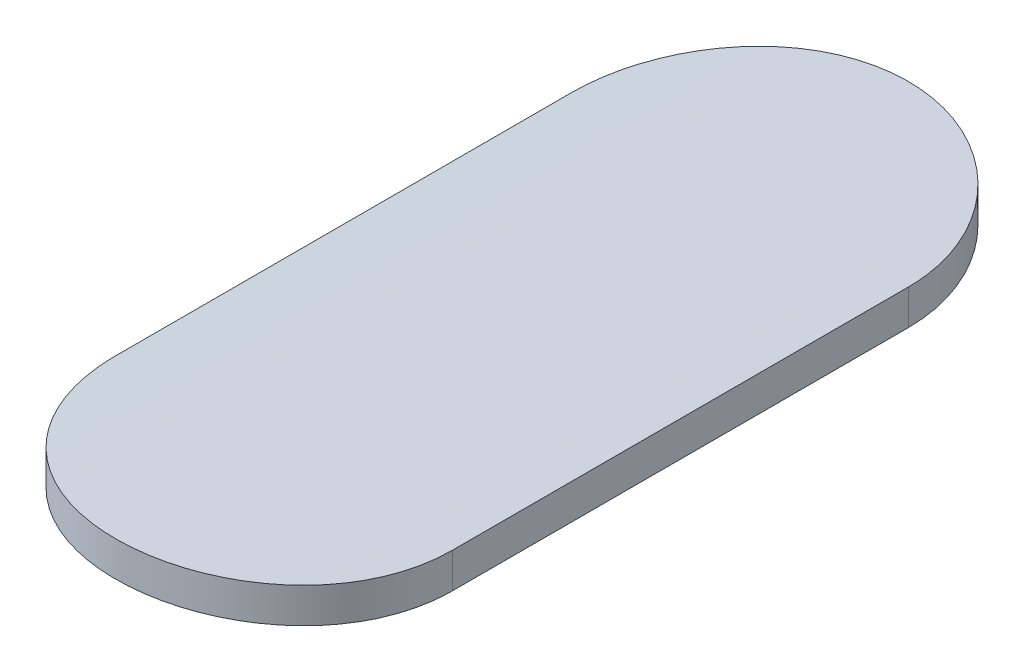
ISO-10303-21;
HEADER;
FILE_DESCRIPTION(('STEP AP214'),'2;1');
FILE_NAME('part.step','',(''),(''),'','','');
FILE_SCHEMA(('AUTOMOTIVE_DESIGN { 1 0 10303 214 1 1 1 1 }'));
ENDSEC;
DATA;
#1=APPLICATION_CONTEXT('core data for automotive mechanical design processes');
#2=APPLICATION_PROTOCOL_DEFINITION('international standard','automotive_design',2000,#1);
#3=PRODUCT_CONTEXT('',#1,'mechanical');
#4=PRODUCT('Part','Part','',(#3));
#5=PRODUCT_RELATED_PRODUCT_CATEGORY('part','',(#4));
#6=PRODUCT_DEFINITION_FORMATION('','',#4);
#7=PRODUCT_DEFINITION_CONTEXT('part definition',#1,'design');
#8=PRODUCT_DEFINITION('design','',#6,#7);
#9=PRODUCT_DEFINITION_SHAPE('','',#8);
#10=(LENGTH_UNIT() NAMED_UNIT(*) SI_UNIT(.MILLI.,.METRE.));
#11=(NAMED_UNIT(*) PLANE_ANGLE_UNIT() SI_UNIT($,.RADIAN.));
#12=(NAMED_UNIT(*) SI_UNIT($,.STERADIAN.) SOLID_ANGLE_UNIT());
#13=UNCERTAINTY_MEASURE_WITH_UNIT(LENGTH_MEASURE(1.E-05),#10,'distance_accuracy_value','');
#14=(GEOMETRIC_REPRESENTATION_CONTEXT(3) GLOBAL_UNCERTAINTY_ASSIGNED_CONTEXT((#13)) GLOBAL_UNIT_ASSIGNED_CONTEXT((#10,
#11,#12)) REPRESENTATION_CONTEXT('',''));
#15=CARTESIAN_POINT('',(0.,0.,0.));
#16=DIRECTION('',(0.,0.,1.));
#17=DIRECTION('',(1.,0.,0.));
#18=AXIS2_PLACEMENT_3D('',#15,#16,#17);
#19=CARTESIAN_POINT('',(-205.237767720161,-97.4477839792411,1.93657000024666));
#20=DIRECTION('',(0.,0.,1.));
#21=DIRECTION('',(1.,0.,0.));
#22=AXIS2_PLACEMENT_3D('',#19,#20,#21);
#23=CYLINDRICAL_SURFACE('',#22,5.00000000000003);
#24=DIRECTION('',(0.,0.,1.));
#25=VECTOR('',#24,1.);
#26=CARTESIAN_POINT('',(-205.816025312001,-92.4813347287725,2.83206474743267));
#27=LINE('',#26,#25);
#28=CARTESIAN_POINT('',(-205.816025312001,-92.4813347287725,1.26705566906287));
#29=VERTEX_POINT('',#28);
#30=CARTESIAN_POINT('',(-205.816025312001,-92.4813347287725,2.83206474743267));
#31=VERTEX_POINT('',#30);
#32=EDGE_CURVE('E72',#29,#31,#27,.T.);
#33=ORIENTED_EDGE('',*,*,#32,.T.);
#34=CARTESIAN_POINT('',(-204.659510128705,-92.4813347287279,2.83206474743267));
#35=CARTESIAN_POINT('',(-204.65948198318,-92.4813470453749,2.86448083062688));
#36=CARTESIAN_POINT('',(-204.66223416535,-92.4810176971892,2.89688619887213));
#37=CARTESIAN_POINT('',(-204.673088717127,-92.4797671597198,2.96074448500112));
#38=CARTESIAN_POINT('',(-204.681185705116,-92.4788465657793,2.99219832768205));
#39=CARTESIAN_POINT('',(-204.702524070631,-92.4765042566045,3.0533024933699));
#40=CARTESIAN_POINT('',(-204.715767326654,-92.4750823584012,3.08295215323607));
#41=CARTESIAN_POINT('',(-204.747006549714,-92.4719020810574,3.1396049404931));
#42=CARTESIAN_POINT('',(-204.765001863621,-92.4701437481661,3.16660843087947));
#43=CARTESIAN_POINT('',(-204.805325364428,-92.4664785790867,3.21733039993261));
#44=CARTESIAN_POINT('',(-204.827671036202,-92.4645711628689,3.24103493719126));
#45=CARTESIAN_POINT('',(-204.876032349208,-92.4608275253215,3.28437421471046));
#46=CARTESIAN_POINT('',(-204.902049364491,-92.4589913309773,3.30400742439501));
#47=CARTESIAN_POINT('',(-204.957107529511,-92.4555908299197,3.33869494452619));
#48=CARTESIAN_POINT('',(-204.986158174165,-92.4540274204009,3.35373426293955));
#49=CARTESIAN_POINT('',(-205.046371666948,-92.4513580548523,3.37869922051583));
#50=CARTESIAN_POINT('',(-205.077531998354,-92.4502515645608,3.3886308353169));
#51=CARTESIAN_POINT('',(-205.13034615267,-92.4488934431359,3.40066816087081));
#52=CARTESIAN_POINT('',(-205.151664012772,-92.4484793797971,3.40428335727667));
#53=CARTESIAN_POINT('',(-205.194574057236,-92.4479245041211,3.40911092828111));
#54=CARTESIAN_POINT('',(-205.216166245618,-92.4477836957932,3.41032326762364));
#55=CARTESIAN_POINT('',(-205.270132833281,-92.4477844039261,3.41032094786131));
#56=CARTESIAN_POINT('',(-205.302518792684,-92.448101558574,3.40759595145511));
#57=CARTESIAN_POINT('',(-205.36639046982,-92.449336246177,3.39676770255847));
#58=CARTESIAN_POINT('',(-205.397875198236,-92.4502544143552,3.38865875953881));
#59=CARTESIAN_POINT('',(-205.459010687186,-92.4525875978119,3.36730369344967));
#60=CARTESIAN_POINT('',(-205.488662624789,-92.4540022902267,3.35406090806612));
#61=CARTESIAN_POINT('',(-205.545317635545,-92.4571708752444,3.32282065546445));
#62=CARTESIAN_POINT('',(-205.572321144898,-92.4589247118479,3.30482397303095));
#63=CARTESIAN_POINT('',(-205.623045523049,-92.4625847434808,3.26449632593292));
#64=CARTESIAN_POINT('',(-205.646752120136,-92.4644915478026,3.24214746487877));
#65=CARTESIAN_POINT('',(-205.690087991771,-92.4682377457699,3.19378617130073));
#66=CARTESIAN_POINT('',(-205.709716908808,-92.4700771334931,3.16777341788066));
#67=CARTESIAN_POINT('',(-205.744395340358,-92.4734866329095,3.11272837641825));
#68=CARTESIAN_POINT('',(-205.759430426865,-92.4750558895899,3.083686951524));
#69=CARTESIAN_POINT('',(-205.784398136002,-92.4777383200303,3.02347434336881));
#70=CARTESIAN_POINT('',(-205.794333600315,-92.4788517477236,2.99230435721046));
#71=CARTESIAN_POINT('',(-205.806375173798,-92.4802182866102,2.93946661392135));
#72=CARTESIAN_POINT('',(-205.809991257807,-92.4806348583557,2.91813495665772));
#73=CARTESIAN_POINT('',(-205.81481628588,-92.4811939415349,2.87522689266801));
#74=CARTESIAN_POINT('',(-205.816028473882,-92.4813368222921,2.85365085534277));
#75=CARTESIAN_POINT('',(-205.816025312001,-92.4813347287726,2.83206474743267));
#76=B_SPLINE_CURVE_WITH_KNOTS('',3,(#34,#35,#36,#37,#38,#39,#40,#41,#42,#43,#44,#45,#46,#47,#48,
#49,#50,#51,#52,#53,#54,#55,#56,#57,#58,#59,#60,#61,#62,#63,#64,#65,#66,#67,#68,#69,#70,#71,#72,
#73,#74,#75),.UNSPECIFIED.,.F.,.F.,(4,2,2,2,2,2,2,2,2,2,2,2,2,2,2,2,2,2,2,2,4),(0.,
0.0971141698560029,0.194130705514869,0.291182687565263,0.388221337553571,0.485658369900075,
0.583131966607678,0.680920348294449,0.778594063001622,0.843344867671607,0.908096622394174,
1.00511304740935,1.10223217692016,1.19928827157682,1.29632835398478,1.3937762336066,
1.49123265335908,1.58899208404563,1.68669698057033,1.75148885975865,1.81619324588167),.UNSPECIFIED.);
#77=CARTESIAN_POINT('',(-204.659510128705,-92.4813347287279,2.83206474743267));
#78=VERTEX_POINT('',#77);
#79=EDGE_CURVE('E21',#78,#31,#76,.T.);
#80=ORIENTED_EDGE('',*,*,#79,.F.);
#81=DIRECTION('',(0.,0.,1.));
#82=VECTOR('',#81,1.);
#83=CARTESIAN_POINT('',(-204.659510128705,-92.4813347287279,1.26705566906287));
#84=LINE('',#83,#82);
#85=CARTESIAN_POINT('',(-204.659510128705,-92.4813347287279,1.26705566906287));
#86=VERTEX_POINT('',#85);
#87=EDGE_CURVE('E59',#78,#86,#84,.F.);
#88=ORIENTED_EDGE('',*,*,#87,.T.);
#89=CARTESIAN_POINT('',(-205.816025312001,-92.4813347287726,1.26705566906287));
#90=CARTESIAN_POINT('',(-205.81605345322,-92.4813470455981,1.23463948872486));
#91=CARTESIAN_POINT('',(-205.813301256707,-92.4810176953498,1.2022340235754));
#92=CARTESIAN_POINT('',(-205.802446677341,-92.4797671542148,1.13837574289801));
#93=CARTESIAN_POINT('',(-205.794349708049,-92.4788465622047,1.10692199708066));
#94=CARTESIAN_POINT('',(-205.773011592033,-92.4765042816047,1.04581857159091));
#95=CARTESIAN_POINT('',(-205.759768660538,-92.4750824191753,1.01616952197206));
#96=CARTESIAN_POINT('',(-205.728529674045,-92.4719021558279,0.959516628595242));
#97=CARTESIAN_POINT('',(-205.710534070537,-92.4701437868815,0.932512533908073));
#98=CARTESIAN_POINT('',(-205.670207756246,-92.4664783744416,0.881787170962223));
#99=CARTESIAN_POINT('',(-205.647859171863,-92.4645707380577,0.858080153163636));
#100=CARTESIAN_POINT('',(-205.599497501548,-92.460827112354,0.814741829426293));
#101=CARTESIAN_POINT('',(-205.573483858366,-92.4589911339836,0.79511114439307));
#102=CARTESIAN_POINT('',(-205.518441967116,-92.4555917582716,0.760434779110686));
#103=CARTESIAN_POINT('',(-205.489405485113,-92.4540291382538,0.745402085847937));
#104=CARTESIAN_POINT('',(-205.429200909222,-92.4513592357457,0.720432369036938));
#105=CARTESIAN_POINT('',(-205.398033010825,-92.4502519115612,0.710494878870013));
#106=CARTESIAN_POINT('',(-205.334596648131,-92.4486214638352,0.696039431545376));
#107=CARTESIAN_POINT('',(-205.302333729771,-92.4480957495245,0.691497433550006));
#108=CARTESIAN_POINT('',(-205.237498790808,-92.4476789168199,0.68788741976827));
#109=CARTESIAN_POINT('',(-205.204926773204,-92.4477877922755,0.688819350928851));
#110=CARTESIAN_POINT('',(-205.140563410856,-92.4486257894006,0.696111573201619));
#111=CARTESIAN_POINT('',(-205.108769075323,-92.4493519393145,0.702445856156913));
#112=CARTESIAN_POINT('',(-205.046697948224,-92.4513395212461,0.720322340750312));
#113=CARTESIAN_POINT('',(-205.016421173954,-92.4526009593627,0.731864601727551));
#114=CARTESIAN_POINT('',(-204.958162773233,-92.4555225006161,0.759857664963218));
#115=CARTESIAN_POINT('',(-204.930186698027,-92.4571835321094,0.776319919517476));
#116=CARTESIAN_POINT('',(-204.87738579882,-92.4607180906581,0.81367655545564));
#117=CARTESIAN_POINT('',(-204.852560962508,-92.4625916168832,0.834570919522292));
#118=CARTESIAN_POINT('',(-204.806616299284,-92.4663540775476,0.880341586026436));
#119=CARTESIAN_POINT('',(-204.785518493568,-92.4682430387985,0.905239996827502));
#120=CARTESIAN_POINT('',(-204.747792196947,-92.4718132541877,0.958244851151834));
#121=CARTESIAN_POINT('',(-204.731165046413,-92.473494445952,0.986352253189699));
#122=CARTESIAN_POINT('',(-204.702849827051,-92.4764596597479,1.04500439396426));
#123=CARTESIAN_POINT('',(-204.691166312109,-92.4777433152941,1.07555134927182));
#124=CARTESIAN_POINT('',(-204.67312304922,-92.479759834021,1.13815473004955));
#125=CARTESIAN_POINT('',(-204.666755270332,-92.4804935279044,1.17020880090798));
#126=CARTESIAN_POINT('',(-204.660710580302,-92.4811955947182,1.22397438759134));
#127=CARTESIAN_POINT('',(-204.659499727931,-92.4813388156744,1.2455201361297));
#128=CARTESIAN_POINT('',(-204.659510128705,-92.4813347287279,1.26705566906287));
#129=B_SPLINE_CURVE_WITH_KNOTS('',3,(#89,#90,#91,#92,#93,#94,#95,#96,#97,#98,#99,#100,#101,#102,
#103,#104,#105,#106,#107,#108,#109,#110,#111,#112,#113,#114,#115,#116,#117,#118,#119,#120,#121,
#122,#123,#124,#125,#126,#127,#128),.UNSPECIFIED.,.F.,.F.,(4,2,2,2,2,2,2,2,2,2,2,2,2,2,2,2,2,2,
2,4),(0.,0.0971144596016325,0.194130705508774,0.291180629617421,0.3882213375778,
0.485669235954979,0.583131966690334,0.680867490696589,0.778594062484608,0.875883538275934,
0.973172071143985,1.06999486157763,1.16681875522746,1.2638698053772,1.36092047633353,
1.4585266740161,1.55616210298787,1.65388727516014,1.75146453691094,1.81606442695371),.UNSPECIFIED.);
#130=EDGE_CURVE('E73',#29,#86,#129,.T.);
#131=ORIENTED_EDGE('',*,*,#130,.F.);
#132=EDGE_LOOP('',(#33,#80,#88,#131));
#133=FACE_BOUND('',#132,.T.);
#134=ADVANCED_FACE('F17',(#133),#23,.T.);
#135=CARTESIAN_POINT('',(-205.816025312001,-90.5682667595488,2.83206474743267));
#136=DIRECTION('',(1.,0.,0.));
#137=DIRECTION('',(0.,1.,0.));
#138=AXIS2_PLACEMENT_3D('',#135,#136,#137);
#139=PLANE('',#138);
#140=DIRECTION('',(0.,0.,1.));
#141=VECTOR('',#140,1.);
#142=CARTESIAN_POINT('',(-205.816025312001,-92.6021655298087,1.93657000024666));
#143=LINE('',#142,#141);
#144=CARTESIAN_POINT('',(-205.816025312001,-92.6021655298087,1.26705566906287));
#145=VERTEX_POINT('',#144);
#146=CARTESIAN_POINT('',(-205.816025312001,-92.6021655298087,2.83206474743267));
#147=VERTEX_POINT('',#146);
#148=EDGE_CURVE('E80',#145,#147,#143,.T.);
#149=ORIENTED_EDGE('',*,*,#148,.T.);
#150=DIRECTION('',(0.,1.,0.));
#151=VECTOR('',#150,1.);
#152=CARTESIAN_POINT('',(-205.816025312001,-90.5682667595488,2.83206474743267));
#153=LINE('',#152,#151);
#154=EDGE_CURVE('E67',#31,#147,#153,.F.);
#155=ORIENTED_EDGE('',*,*,#154,.F.);
#156=ORIENTED_EDGE('',*,*,#32,.F.);
#157=DIRECTION('',(0.,1.,0.));
#158=VECTOR('',#157,1.);
#159=CARTESIAN_POINT('',(-205.816025312001,-90.5682667595488,1.26705566906287));
#160=LINE('',#159,#158);
#161=EDGE_CURVE('E106',#145,#29,#160,.T.);
#162=ORIENTED_EDGE('',*,*,#161,.F.);
#163=EDGE_LOOP('',(#149,#155,#156,#162));
#164=FACE_BOUND('',#163,.T.);
#165=ADVANCED_FACE('F79',(#164),#139,.F.);
#166=CARTESIAN_POINT('',(-205.237767720353,-90.5682667595488,2.83206474743267));
#167=DIRECTION('',(0.,1.,0.));
#168=DIRECTION('',(0.,0.,1.));
#169=AXIS2_PLACEMENT_3D('',#166,#167,#168);
#170=CYLINDRICAL_SURFACE('',#169,0.578257591648153);
#171=DIRECTION('',(0.,1.,0.));
#172=VECTOR('',#171,1.);
#173=CARTESIAN_POINT('',(-204.659510128705,-90.5682667595488,2.83206474743267));
#174=LINE('',#173,#172);
#175=CARTESIAN_POINT('',(-204.659510128705,-92.6021655297629,2.83206474743267));
#176=VERTEX_POINT('',#175);
#177=EDGE_CURVE('E69',#176,#78,#174,.T.);
#178=ORIENTED_EDGE('',*,*,#177,.T.);
#179=ORIENTED_EDGE('',*,*,#79,.T.);
#180=ORIENTED_EDGE('',*,*,#154,.T.);
#181=CARTESIAN_POINT('',(-205.816025312001,-92.6021655298087,2.83206474743267));
#182=CARTESIAN_POINT('',(-205.816053483011,-92.6021781533448,2.86447510734879));
#183=CARTESIAN_POINT('',(-205.813302242279,-92.6018407072796,2.89687462882628));
#184=CARTESIAN_POINT('',(-205.802451748411,-92.6005594713111,2.96072074587371));
#185=CARTESIAN_POINT('',(-205.79435794951,-92.5996162998216,2.99216827912329));
#186=CARTESIAN_POINT('',(-205.773028532762,-92.5972166227453,3.05325988359222));
#187=CARTESIAN_POINT('',(-205.759791067541,-92.5957599327431,3.082903302425));
#188=CARTESIAN_POINT('',(-205.72856598305,-92.592501890348,3.13954487913786));
#189=CARTESIAN_POINT('',(-205.710578992223,-92.5907005835624,3.16654338633738));
#190=CARTESIAN_POINT('',(-205.670270074694,-92.5869454143927,3.21726286129699));
#191=CARTESIAN_POINT('',(-205.647929782689,-92.5849909274355,3.24096918801718));
#192=CARTESIAN_POINT('',(-205.599578955999,-92.5811547858218,3.28431336897484));
#193=CARTESIAN_POINT('',(-205.573567048307,-92.5792731587483,3.30394969441672));
#194=CARTESIAN_POINT('',(-205.518514038446,-92.5757880639238,3.33864740343867));
#195=CARTESIAN_POINT('',(-205.489463015216,-92.5741855557636,3.35369313311189));
#196=CARTESIAN_POINT('',(-205.429246573441,-92.5714492396962,3.37867044092609));
#197=CARTESIAN_POINT('',(-205.398083675089,-92.5703148842015,3.38860799734299));
#198=CARTESIAN_POINT('',(-205.345254120649,-92.568922106144,3.40065639962148));
#199=CARTESIAN_POINT('',(-205.323923699689,-92.5684973477259,3.40427598594697));
#200=CARTESIAN_POINT('',(-205.280987857234,-92.5679281371332,3.40910943765987));
#201=CARTESIAN_POINT('',(-205.259382431801,-92.5677836889786,3.41032326854638));
#202=CARTESIAN_POINT('',(-205.205408498434,-92.5677844137908,3.41032094758493));
#203=CARTESIAN_POINT('',(-205.173028463901,-92.5681092485121,3.40759693085569));
#204=CARTESIAN_POINT('',(-205.109168744159,-92.5693738397721,3.39677275819583));
#205=CARTESIAN_POINT('',(-205.077690046997,-92.5703142460471,3.38866692162019));
#206=CARTESIAN_POINT('',(-205.016566704827,-92.572703965736,3.36732059128195));
#207=CARTESIAN_POINT('',(-204.986920864252,-92.5741529432019,3.35408348649129));
#208=CARTESIAN_POINT('',(-204.930276903842,-92.5773984387611,3.32285715192262));
#209=CARTESIAN_POINT('',(-204.903278353576,-92.5791949002142,3.30486869644372));
#210=CARTESIAN_POINT('',(-204.852556592957,-92.5829445142571,3.26455555043895));
#211=CARTESIAN_POINT('',(-204.828848336295,-92.5848983222903,3.24221210554184));
#212=CARTESIAN_POINT('',(-204.785507790757,-92.5887372053062,3.1938614021358));
#213=CARTESIAN_POINT('',(-204.765875861897,-92.5906222742059,3.16785382035527));
#214=CARTESIAN_POINT('',(-204.731187341408,-92.5941170846154,3.11281396470444));
#215=CARTESIAN_POINT('',(-204.716145861998,-92.5957259092593,3.08377211403318));
#216=CARTESIAN_POINT('',(-204.691165865014,-92.5984762631509,3.02355651012208));
#217=CARTESIAN_POINT('',(-204.681224494261,-92.5996180536012,2.99238395995641));
#218=CARTESIAN_POINT('',(-204.669171948261,-92.6010198762337,2.93953098820856));
#219=CARTESIAN_POINT('',(-204.665551522192,-92.601447339911,2.91818694788933));
#220=CARTESIAN_POINT('',(-204.660720634795,-92.6020210553048,2.87525330757468));
#221=CARTESIAN_POINT('',(-204.659506943357,-92.6021676839245,2.8536640758702));
#222=CARTESIAN_POINT('',(-204.659510128705,-92.6021655297629,2.83206474743268));
#223=B_SPLINE_CURVE_WITH_KNOTS('',3,(#181,#182,#183,#184,#185,#186,#187,#188,#189,#190,#191,
#192,#193,#194,#195,#196,#197,#198,#199,#200,#201,#202,#203,#204,#205,#206,#207,#208,#209,#210,
#211,#212,#213,#214,#215,#216,#217,#218,#219,#220,#221,#222),.UNSPECIFIED.,.F.,.F.,(4,2,2,2,2,2,
2,2,2,2,2,2,2,2,2,2,2,2,2,2,4),(0.,0.0970967769414798,0.19409458046097,0.291127253506242,
0.388147093901721,0.485585457891435,0.583060356133906,0.680864021117866,0.778552960900412,
0.843343411859868,0.908134791971194,1.00513347976352,1.10223471520449,1.19927192861069,
1.29629333819037,1.39374218059266,1.49119962589251,1.58897453338935,1.68669468236565,
1.75152566852515,1.81626958514255),.UNSPECIFIED.);
#224=EDGE_CURVE('E91',#147,#176,#223,.T.);
#225=ORIENTED_EDGE('',*,*,#224,.T.);
#226=EDGE_LOOP('',(#178,#179,#180,#225));
#227=FACE_BOUND('',#226,.T.);
#228=ADVANCED_FACE('F65',(#227),#170,.T.);
#229=CARTESIAN_POINT('',(-204.659510128705,-90.5682667595488,1.26705566906287));
#230=DIRECTION('',(-1.,0.,0.));
#231=DIRECTION('',(0.,0.,1.));
#232=AXIS2_PLACEMENT_3D('',#229,#230,#231);
#233=PLANE('',#232);
#234=DIRECTION('',(0.,0.,1.));
#235=VECTOR('',#234,1.);
#236=CARTESIAN_POINT('',(-204.659510128705,-92.6021655297629,1.93657000024666));
#237=LINE('',#236,#235);
#238=CARTESIAN_POINT('',(-204.659510128705,-92.6021655297629,1.26705566906287));
#239=VERTEX_POINT('',#238);
#240=EDGE_CURVE('E31',#176,#239,#237,.F.);
#241=ORIENTED_EDGE('',*,*,#240,.T.);
#242=DIRECTION('',(0.,1.,0.));
#243=VECTOR('',#242,1.);
#244=CARTESIAN_POINT('',(-204.659510128705,-90.5682667595488,1.26705566906287));
#245=LINE('',#244,#243);
#246=EDGE_CURVE('E39',#86,#239,#245,.F.);
#247=ORIENTED_EDGE('',*,*,#246,.F.);
#248=ORIENTED_EDGE('',*,*,#87,.F.);
#249=ORIENTED_EDGE('',*,*,#177,.F.);
#250=EDGE_LOOP('',(#241,#247,#248,#249));
#251=FACE_BOUND('',#250,.T.);
#252=ADVANCED_FACE('F101',(#251),#233,.F.);
#253=CARTESIAN_POINT('',(-205.237767720353,-90.5682667595488,1.26705566906287));
#254=DIRECTION('',(0.,1.,0.));
#255=DIRECTION('',(0.,0.,1.));
#256=AXIS2_PLACEMENT_3D('',#253,#254,#255);
#257=CYLINDRICAL_SURFACE('',#256,0.57825759164816);
#258=ORIENTED_EDGE('',*,*,#246,.T.);
#259=CARTESIAN_POINT('',(-204.659510128705,-92.6021655297629,1.26705566906287));
#260=CARTESIAN_POINT('',(-204.659481961999,-92.6021781534809,1.23464521305936));
#261=CARTESIAN_POINT('',(-204.662233216893,-92.6018407053248,1.20224559573053));
#262=CARTESIAN_POINT('',(-204.673083737999,-92.6005594656419,1.13839948407462));
#263=CARTESIAN_POINT('',(-204.681177518388,-92.5996162961099,1.10695204663423));
#264=CARTESIAN_POINT('',(-204.702506686611,-92.5972166482127,1.04586117970318));
#265=CARTESIAN_POINT('',(-204.715743828236,-92.5957599947747,1.01621836954939));
#266=CARTESIAN_POINT('',(-204.746968676782,-92.5925019666882,0.959576687021124));
#267=CARTESIAN_POINT('',(-204.764955956315,-92.5907006230567,0.932577577082591));
#268=CARTESIAN_POINT('',(-204.805267682024,-92.5869452049457,0.881854713706098));
#269=CARTESIAN_POINT('',(-204.827610881779,-92.5849904927257,0.858145909907152));
#270=CARTESIAN_POINT('',(-204.875962064954,-92.5811543632185,0.814802681049241));
#271=CARTESIAN_POINT('',(-204.901970605743,-92.5792729571343,0.795168876776769));
#272=CARTESIAN_POINT('',(-204.957007359644,-92.5757890145145,0.760482315201175));
#273=CARTESIAN_POINT('',(-204.986044233255,-92.5741873148731,0.745443208121212));
#274=CARTESIAN_POINT('',(-205.046251761114,-92.5714504492918,0.720461145179634));
#275=CARTESIAN_POINT('',(-205.077422216702,-92.5703152399854,0.710517715586689));
#276=CARTESIAN_POINT('',(-205.140858450405,-92.5686436759724,0.69605321346097));
#277=CARTESIAN_POINT('',(-205.173118400204,-92.5681045352239,0.691506907191285));
#278=CARTESIAN_POINT('',(-205.237948363892,-92.5676763461855,0.687887513706541));
#279=CARTESIAN_POINT('',(-205.270518374271,-92.5677872905474,0.688814364625489));
#280=CARTESIAN_POINT('',(-205.334870590047,-92.5686445338117,0.696094877489352));
#281=CARTESIAN_POINT('',(-205.366655931583,-92.5693876374871,0.702421248278067));
#282=CARTESIAN_POINT('',(-205.428710384106,-92.571422086611,0.720278563632503));
#283=CARTESIAN_POINT('',(-205.458979476824,-92.5727134386636,0.731809570893257));
#284=CARTESIAN_POINT('',(-205.517227863834,-92.5757048001304,0.759778374562153));
#285=CARTESIAN_POINT('',(-205.545201352274,-92.5774058053395,0.77622815154839));
#286=CARTESIAN_POINT('',(-205.597999733442,-92.5810258910445,0.81355805418508));
#287=CARTESIAN_POINT('',(-205.622824631438,-92.5829449711756,0.83443817242434));
#288=CARTESIAN_POINT('',(-205.668779656381,-92.5868000571643,0.880186104254391));
#289=CARTESIAN_POINT('',(-205.689886659469,-92.5887360953951,0.905077149920945));
#290=CARTESIAN_POINT('',(-205.727632669796,-92.5923958859476,0.958069418003858));
#291=CARTESIAN_POINT('',(-205.74427034065,-92.5941195746911,0.986171597016356));
#292=CARTESIAN_POINT('',(-205.772607859074,-92.5971604007767,1.04481686387099));
#293=CARTESIAN_POINT('',(-205.784303026303,-92.5984771524508,1.07536223291189));
#294=CARTESIAN_POINT('',(-205.802369312691,-92.6005463291697,1.13796542095854));
#295=CARTESIAN_POINT('',(-205.808748459045,-92.6012996048868,1.1700208821038));
#296=CARTESIAN_POINT('',(-205.814817911293,-92.6020220986538,1.22385000978716));
#297=CARTESIAN_POINT('',(-205.816035806626,-92.6021697551819,1.2454579288767));
#298=CARTESIAN_POINT('',(-205.816025312001,-92.6021655298087,1.26705566906287));
#299=B_SPLINE_CURVE_WITH_KNOTS('',3,(#259,#260,#261,#262,#263,#264,#265,#266,#267,#268,#269,
#270,#271,#272,#273,#274,#275,#276,#277,#278,#279,#280,#281,#282,#283,#284,#285,#286,#287,#288,
#289,#290,#291,#292,#293,#294,#295,#296,#297,#298),.UNSPECIFIED.,.F.,.F.,(4,2,2,2,2,2,2,2,2,2,2,
2,2,2,2,2,2,2,2,4),(0.,0.0970970635383439,0.194094580457033,0.291125200810016,0.388147093931791,
0.485596307798183,0.583060356224462,0.680811202926199,0.778552960347218,0.875835912772301,
0.973117765558749,1.06991081233852,1.1667050251181,1.26373694568975,1.36076870394509,
1.45838414810373,1.5560287480759,1.65376560730432,1.75135461501378,1.81614074530075),.UNSPECIFIED.);
#300=EDGE_CURVE('E11',#239,#145,#299,.T.);
#301=ORIENTED_EDGE('',*,*,#300,.T.);
#302=ORIENTED_EDGE('',*,*,#161,.T.);
#303=ORIENTED_EDGE('',*,*,#130,.T.);
#304=EDGE_LOOP('',(#258,#301,#302,#303));
#305=FACE_BOUND('',#304,.T.);
#306=ADVANCED_FACE('F97',(#305),#257,.T.);
#307=CARTESIAN_POINT('',(-205.237767720161,-97.4477839792411,1.93657000024666));
#308=DIRECTION('',(0.,0.,1.));
#309=DIRECTION('',(1.,0.,0.));
#310=AXIS2_PLACEMENT_3D('',#307,#308,#309);
#311=CYLINDRICAL_SURFACE('',#310,4.88000000000002);
#312=ORIENTED_EDGE('',*,*,#240,.F.);
#313=ORIENTED_EDGE('',*,*,#224,.F.);
#314=ORIENTED_EDGE('',*,*,#148,.F.);
#315=ORIENTED_EDGE('',*,*,#300,.F.);
#316=EDGE_LOOP('',(#312,#313,#314,#315));
#317=FACE_BOUND('',#316,.T.);
#318=ADVANCED_FACE('F95',(#317),#311,.F.);
#319=CLOSED_SHELL('',(#134,#165,#228,#252,#306,#318));
#320=MANIFOLD_SOLID_BREP('B1',#319);
#321=ADVANCED_BREP_SHAPE_REPRESENTATION('',(#18,#320),#14);
#322=SHAPE_DEFINITION_REPRESENTATION(#9,#321);
ENDSEC;
END-ISO-10303-21;
